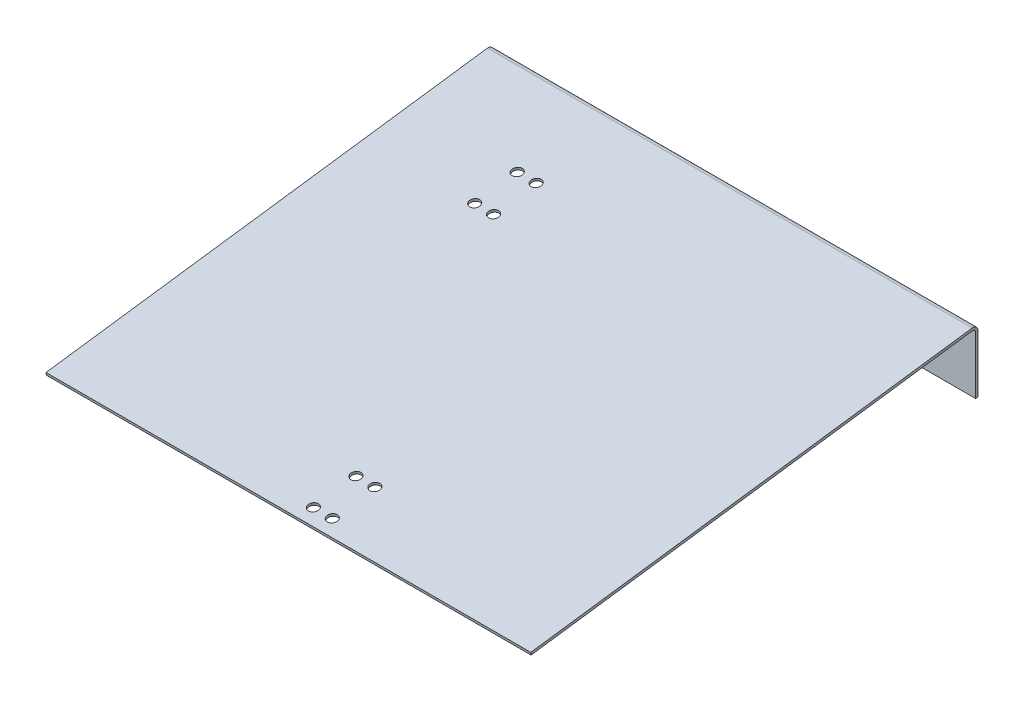
ISO-10303-21;
HEADER;
FILE_DESCRIPTION(('STEP AP214'),'2;1');
FILE_NAME('part.step','',(''),(''),'','','');
FILE_SCHEMA(('AUTOMOTIVE_DESIGN { 1 0 10303 214 1 1 1 1 }'));
ENDSEC;
DATA;
#1=APPLICATION_CONTEXT('core data for automotive mechanical design processes');
#2=APPLICATION_PROTOCOL_DEFINITION('international standard','automotive_design',2000,#1);
#3=PRODUCT_CONTEXT('',#1,'mechanical');
#4=PRODUCT('Part','Part','',(#3));
#5=PRODUCT_RELATED_PRODUCT_CATEGORY('part','',(#4));
#6=PRODUCT_DEFINITION_FORMATION('','',#4);
#7=PRODUCT_DEFINITION_CONTEXT('part definition',#1,'design');
#8=PRODUCT_DEFINITION('design','',#6,#7);
#9=PRODUCT_DEFINITION_SHAPE('','',#8);
#10=(LENGTH_UNIT() NAMED_UNIT(*) SI_UNIT(.MILLI.,.METRE.));
#11=(NAMED_UNIT(*) PLANE_ANGLE_UNIT() SI_UNIT($,.RADIAN.));
#12=(NAMED_UNIT(*) SI_UNIT($,.STERADIAN.) SOLID_ANGLE_UNIT());
#13=UNCERTAINTY_MEASURE_WITH_UNIT(LENGTH_MEASURE(1.E-05),#10,'distance_accuracy_value','');
#14=(GEOMETRIC_REPRESENTATION_CONTEXT(3) GLOBAL_UNCERTAINTY_ASSIGNED_CONTEXT((#13)) GLOBAL_UNIT_ASSIGNED_CONTEXT((#10,
#11,#12)) REPRESENTATION_CONTEXT('',''));
#15=CARTESIAN_POINT('',(0.,0.,0.));
#16=DIRECTION('',(0.,0.,1.));
#17=DIRECTION('',(1.,0.,0.));
#18=AXIS2_PLACEMENT_3D('',#15,#16,#17);
#19=CARTESIAN_POINT('',(304.8,76.2,-282.575));
#20=DIRECTION('',(0.,0.,1.));
#21=DIRECTION('',(1.,0.,0.));
#22=AXIS2_PLACEMENT_3D('',#19,#20,#21);
#23=PLANE('',#22);
#24=DIRECTION('',(0.,1.,0.));
#25=VECTOR('',#24,1.);
#26=CARTESIAN_POINT('',(-304.8,39.009334551279,-282.575));
#27=LINE('',#26,#25);
#28=CARTESIAN_POINT('',(-304.8,72.5626617948586,-282.575));
#29=VERTEX_POINT('',#28);
#30=CARTESIAN_POINT('',(-304.8,0.,-282.575));
#31=VERTEX_POINT('',#30);
#32=EDGE_CURVE('E63',#29,#31,#27,.F.);
#33=ORIENTED_EDGE('',*,*,#32,.F.);
#34=DIRECTION('',(1.,0.,0.));
#35=VECTOR('',#34,1.);
#36=CARTESIAN_POINT('',(304.8,72.5626617948586,-282.575));
#37=LINE('',#36,#35);
#38=CARTESIAN_POINT('',(304.8,72.5626617948586,-282.575));
#39=VERTEX_POINT('',#38);
#40=EDGE_CURVE('E84',#39,#29,#37,.F.);
#41=ORIENTED_EDGE('',*,*,#40,.F.);
#42=DIRECTION('',(0.,1.,0.));
#43=VECTOR('',#42,1.);
#44=CARTESIAN_POINT('',(304.8,39.009334551279,-282.575));
#45=LINE('',#44,#43);
#46=CARTESIAN_POINT('',(304.8,0.,-282.575));
#47=VERTEX_POINT('',#46);
#48=EDGE_CURVE('E83',#39,#47,#45,.F.);
#49=ORIENTED_EDGE('',*,*,#48,.T.);
#50=DIRECTION('',(1.,0.,0.));
#51=VECTOR('',#50,1.);
#52=CARTESIAN_POINT('',(0.,0.,-282.575));
#53=LINE('',#52,#51);
#54=EDGE_CURVE('E80',#47,#31,#53,.F.);
#55=ORIENTED_EDGE('',*,*,#54,.T.);
#56=EDGE_LOOP('',(#33,#41,#49,#55));
#57=FACE_BOUND('',#56,.T.);
#58=ADVANCED_FACE('F17',(#57),#23,.F.);
#59=CARTESIAN_POINT('',(0.,0.,-280.9875));
#60=DIRECTION('',(0.,1.,0.));
#61=DIRECTION('',(0.,0.,1.));
#62=AXIS2_PLACEMENT_3D('',#59,#60,#61);
#63=PLANE('',#62);
#64=ORIENTED_EDGE('',*,*,#54,.F.);
#65=DIRECTION('',(0.,0.,1.));
#66=VECTOR('',#65,1.);
#67=CARTESIAN_POINT('',(304.8,0.,-280.9875));
#68=LINE('',#67,#66);
#69=CARTESIAN_POINT('',(304.8,0.,-279.4));
#70=VERTEX_POINT('',#69);
#71=EDGE_CURVE('E72',#47,#70,#68,.T.);
#72=ORIENTED_EDGE('',*,*,#71,.T.);
#73=DIRECTION('',(1.,0.,0.));
#74=VECTOR('',#73,1.);
#75=CARTESIAN_POINT('',(304.8,0.,-279.4));
#76=LINE('',#75,#74);
#77=CARTESIAN_POINT('',(-304.8,0.,-279.4));
#78=VERTEX_POINT('',#77);
#79=EDGE_CURVE('E105',#78,#70,#76,.T.);
#80=ORIENTED_EDGE('',*,*,#79,.F.);
#81=DIRECTION('',(0.,0.,1.));
#82=VECTOR('',#81,1.);
#83=CARTESIAN_POINT('',(-304.8,0.,-280.9875));
#84=LINE('',#83,#82);
#85=EDGE_CURVE('E88',#31,#78,#84,.T.);
#86=ORIENTED_EDGE('',*,*,#85,.F.);
#87=EDGE_LOOP('',(#64,#72,#80,#86));
#88=FACE_BOUND('',#87,.T.);
#89=ADVANCED_FACE('F90',(#88),#63,.F.);
#90=CARTESIAN_POINT('',(304.8,72.5626617948586,-276.225));
#91=DIRECTION('',(1.,0.,0.));
#92=DIRECTION('',(0.,0.,-1.));
#93=AXIS2_PLACEMENT_3D('',#90,#91,#92);
#94=CYLINDRICAL_SURFACE('',#93,6.35);
#95=CARTESIAN_POINT('',(304.8,72.5626617948586,-276.225));
#96=DIRECTION('',(1.,0.,0.));
#97=DIRECTION('',(0.,0.,-1.));
#98=AXIS2_PLACEMENT_3D('',#95,#96,#97);
#99=CIRCLE('',#98,6.35);
#100=CARTESIAN_POINT('',(304.8,78.8544333619389,-275.367031149986));
#101=VERTEX_POINT('',#100);
#102=EDGE_CURVE('E165',#39,#101,#99,.T.);
#103=ORIENTED_EDGE('',*,*,#102,.F.);
#104=ORIENTED_EDGE('',*,*,#40,.T.);
#105=CARTESIAN_POINT('',(-304.8,72.5626617948586,-276.225));
#106=DIRECTION('',(1.,0.,0.));
#107=DIRECTION('',(0.,0.,-1.));
#108=AXIS2_PLACEMENT_3D('',#105,#106,#107);
#109=CIRCLE('',#108,6.35);
#110=CARTESIAN_POINT('',(-304.8,78.8544333619389,-275.367031149986));
#111=VERTEX_POINT('',#110);
#112=EDGE_CURVE('E20',#29,#111,#109,.T.);
#113=ORIENTED_EDGE('',*,*,#112,.T.);
#114=DIRECTION('',(1.,0.,0.));
#115=VECTOR('',#114,1.);
#116=CARTESIAN_POINT('',(304.8,78.854433361943,-275.367031150027));
#117=LINE('',#116,#115);
#118=EDGE_CURVE('E166',#111,#101,#117,.T.);
#119=ORIENTED_EDGE('',*,*,#118,.T.);
#120=EDGE_LOOP('',(#103,#104,#113,#119));
#121=FACE_BOUND('',#120,.T.);
#122=ADVANCED_FACE('F301',(#121),#94,.T.);
#123=CARTESIAN_POINT('',(304.8,76.2,-279.4));
#124=DIRECTION('',(0.,0.,1.));
#125=DIRECTION('',(1.,0.,0.));
#126=AXIS2_PLACEMENT_3D('',#123,#124,#125);
#127=PLANE('',#126);
#128=ORIENTED_EDGE('',*,*,#79,.T.);
#129=DIRECTION('',(0.,1.,0.));
#130=VECTOR('',#129,1.);
#131=CARTESIAN_POINT('',(304.8,76.2,-279.4));
#132=LINE('',#131,#130);
#133=CARTESIAN_POINT('',(304.8,72.5626617948586,-279.4));
#134=VERTEX_POINT('',#133);
#135=EDGE_CURVE('E94',#70,#134,#132,.T.);
#136=ORIENTED_EDGE('',*,*,#135,.T.);
#137=DIRECTION('',(1.,0.,0.));
#138=VECTOR('',#137,1.);
#139=CARTESIAN_POINT('',(304.8,72.5626617948586,-279.4));
#140=LINE('',#139,#138);
#141=CARTESIAN_POINT('',(-304.8,72.5626617948586,-279.4));
#142=VERTEX_POINT('',#141);
#143=EDGE_CURVE('E164',#134,#142,#140,.F.);
#144=ORIENTED_EDGE('',*,*,#143,.T.);
#145=DIRECTION('',(0.,1.,0.));
#146=VECTOR('',#145,1.);
#147=CARTESIAN_POINT('',(-304.8,76.2,-279.4));
#148=LINE('',#147,#146);
#149=EDGE_CURVE('E97',#142,#78,#148,.F.);
#150=ORIENTED_EDGE('',*,*,#149,.T.);
#151=EDGE_LOOP('',(#128,#136,#144,#150));
#152=FACE_BOUND('',#151,.T.);
#153=ADVANCED_FACE('F293',(#152),#127,.T.);
#154=CARTESIAN_POINT('',(304.8,3.1458857835397,279.828984424986));
#155=DIRECTION('',(0.,-0.990830168044301,-0.1351132047333));
#156=DIRECTION('',(0.,0.1351132047333,-0.990830168044301));
#157=AXIS2_PLACEMENT_3D('',#154,#155,#156);
#158=PLANE('',#157);
#159=CARTESIAN_POINT('',(12.7,5.70055573305718,261.094738128505));
#160=DIRECTION('',(0.,-0.990830168044301,-0.1351132047333));
#161=DIRECTION('',(0.,0.1351132047333,-0.990830168044301));
#162=AXIS2_PLACEMENT_3D('',#159,#160,#161);
#163=CIRCLE('',#162,6.35);
#164=CARTESIAN_POINT('',(12.7,6.55852458311364,254.802966561423));
#165=VERTEX_POINT('',#164);
#166=EDGE_CURVE('E135',#165,#165,#163,.T.);
#167=ORIENTED_EDGE('',*,*,#166,.T.);
#168=EDGE_LOOP('',(#167));
#169=FACE_BOUND('',#168,.T.);
#170=CARTESIAN_POINT('',(36.5125,5.70055573305718,261.094738128505));
#171=DIRECTION('',(0.,-0.990830168044301,-0.1351132047333));
#172=DIRECTION('',(0.,0.1351132047333,-0.990830168044301));
#173=AXIS2_PLACEMENT_3D('',#170,#171,#172);
#174=CIRCLE('',#173,6.35);
#175=CARTESIAN_POINT('',(36.5125,6.55852458311364,254.802966561423));
#176=VERTEX_POINT('',#175);
#177=EDGE_CURVE('E139',#176,#176,#174,.T.);
#178=ORIENTED_EDGE('',*,*,#177,.T.);
#179=EDGE_LOOP('',(#178));
#180=FACE_BOUND('',#179,.T.);
#181=CARTESIAN_POINT('',(36.5125,12.9932909585321,207.614679808418));
#182=DIRECTION('',(0.,-0.990830168044301,-0.1351132047333));
#183=DIRECTION('',(0.,0.1351132047333,-0.990830168044301));
#184=AXIS2_PLACEMENT_3D('',#181,#182,#183);
#185=CIRCLE('',#184,6.35);
#186=CARTESIAN_POINT('',(36.5125,13.8512598085886,201.322908241337));
#187=VERTEX_POINT('',#186);
#188=EDGE_CURVE('E142',#187,#187,#185,.T.);
#189=ORIENTED_EDGE('',*,*,#188,.T.);
#190=EDGE_LOOP('',(#189));
#191=FACE_BOUND('',#190,.T.);
#192=CARTESIAN_POINT('',(12.7,12.9932909585321,207.614679808418));
#193=DIRECTION('',(0.,-0.990830168044301,-0.1351132047333));
#194=DIRECTION('',(0.,0.1351132047333,-0.990830168044301));
#195=AXIS2_PLACEMENT_3D('',#192,#193,#194);
#196=CIRCLE('',#195,6.35);
#197=CARTESIAN_POINT('',(12.7,13.8512598085886,201.322908241337));
#198=VERTEX_POINT('',#197);
#199=EDGE_CURVE('E145',#198,#198,#196,.T.);
#200=ORIENTED_EDGE('',*,*,#199,.T.);
#201=EDGE_LOOP('',(#200));
#202=FACE_BOUND('',#201,.T.);
#203=CARTESIAN_POINT('',(-165.1,57.6076711614827,-119.55744167981));
#204=DIRECTION('',(0.,-0.990830168044301,-0.1351132047333));
#205=DIRECTION('',(0.,0.1351132047333,-0.990830168044301));
#206=AXIS2_PLACEMENT_3D('',#203,#204,#205);
#207=CIRCLE('',#206,6.35);
#208=CARTESIAN_POINT('',(-165.1,58.4656400115391,-125.849213246891));
#209=VERTEX_POINT('',#208);
#210=EDGE_CURVE('E148',#209,#209,#207,.T.);
#211=ORIENTED_EDGE('',*,*,#210,.T.);
#212=EDGE_LOOP('',(#211));
#213=FACE_BOUND('',#212,.T.);
#214=CARTESIAN_POINT('',(-141.2875,57.6076711614827,-119.55744167981));
#215=DIRECTION('',(0.,-0.990830168044301,-0.1351132047333));
#216=DIRECTION('',(0.,0.1351132047333,-0.990830168044301));
#217=AXIS2_PLACEMENT_3D('',#214,#215,#216);
#218=CIRCLE('',#217,6.35);
#219=CARTESIAN_POINT('',(-141.2875,58.4656400115391,-125.849213246891));
#220=VERTEX_POINT('',#219);
#221=EDGE_CURVE('E151',#220,#220,#218,.T.);
#222=ORIENTED_EDGE('',*,*,#221,.T.);
#223=EDGE_LOOP('',(#222));
#224=FACE_BOUND('',#223,.T.);
#225=CARTESIAN_POINT('',(-141.2875,64.9004063869563,-173.037500000001));
#226=DIRECTION('',(0.,-0.990830168044301,-0.1351132047333));
#227=DIRECTION('',(0.,0.1351132047333,-0.990830168044301));
#228=AXIS2_PLACEMENT_3D('',#225,#226,#227);
#229=CIRCLE('',#228,6.35);
#230=CARTESIAN_POINT('',(-141.2875,65.7583752370128,-179.329271567082));
#231=VERTEX_POINT('',#230);
#232=EDGE_CURVE('E154',#231,#231,#229,.T.);
#233=ORIENTED_EDGE('',*,*,#232,.T.);
#234=EDGE_LOOP('',(#233));
#235=FACE_BOUND('',#234,.T.);
#236=CARTESIAN_POINT('',(-165.1,64.9004063869563,-173.037500000001));
#237=DIRECTION('',(0.,-0.990830168044301,-0.1351132047333));
#238=DIRECTION('',(0.,0.1351132047333,-0.990830168044301));
#239=AXIS2_PLACEMENT_3D('',#236,#237,#238);
#240=CIRCLE('',#239,6.35);
#241=CARTESIAN_POINT('',(-165.1,65.7583752370128,-179.329271567082));
#242=VERTEX_POINT('',#241);
#243=EDGE_CURVE('E157',#242,#242,#240,.T.);
#244=ORIENTED_EDGE('',*,*,#243,.T.);
#245=EDGE_LOOP('',(#244));
#246=FACE_BOUND('',#245,.T.);
#247=DIRECTION('',(0.,0.135113204733291,-0.990830168044302));
#248=VECTOR('',#247,1.);
#249=CARTESIAN_POINT('',(-304.8,3.1458857835397,279.828984424986));
#250=LINE('',#249,#248);
#251=CARTESIAN_POINT('',(-304.8,3.1458857835331,279.828984425034));
#252=VERTEX_POINT('',#251);
#253=EDGE_CURVE('E188',#252,#111,#250,.T.);
#254=ORIENTED_EDGE('',*,*,#253,.F.);
#255=DIRECTION('',(1.,0.,0.));
#256=VECTOR('',#255,1.);
#257=CARTESIAN_POINT('',(0.,3.14588578351989,279.828984425131));
#258=LINE('',#257,#256);
#259=CARTESIAN_POINT('',(304.8,3.14588578352484,279.828984425095));
#260=VERTEX_POINT('',#259);
#261=EDGE_CURVE('E169',#260,#252,#258,.F.);
#262=ORIENTED_EDGE('',*,*,#261,.F.);
#263=DIRECTION('',(0.,0.135113204733291,-0.990830168044302));
#264=VECTOR('',#263,1.);
#265=CARTESIAN_POINT('',(304.8,3.1458857835397,279.828984424986));
#266=LINE('',#265,#264);
#267=EDGE_CURVE('E160',#260,#101,#266,.T.);
#268=ORIENTED_EDGE('',*,*,#267,.T.);
#269=ORIENTED_EDGE('',*,*,#118,.F.);
#270=EDGE_LOOP('',(#254,#262,#268,#269));
#271=FACE_BOUND('',#270,.T.);
#272=ADVANCED_FACE('F219',(#169,#180,#191,#202,#213,#224,#235,#246,#271),#158,.F.);
#273=CARTESIAN_POINT('',(0.,1.57294289177036,279.61449221262));
#274=DIRECTION('',(0.,-0.1351132047333,0.990830168044301));
#275=DIRECTION('',(0.,-0.990830168044301,-0.1351132047333));
#276=AXIS2_PLACEMENT_3D('',#273,#274,#275);
#277=PLANE('',#276);
#278=DIRECTION('',(0.,0.990830168046075,0.135113204720287));
#279=VECTOR('',#278,1.);
#280=CARTESIAN_POINT('',(-304.8,0.,279.4));
#281=LINE('',#280,#279);
#282=CARTESIAN_POINT('',(-304.8,-3.54694420614099E-12,279.400000000026));
#283=VERTEX_POINT('',#282);
#284=EDGE_CURVE('E191',#283,#252,#281,.T.);
#285=ORIENTED_EDGE('',*,*,#284,.F.);
#286=DIRECTION('',(1.,0.,0.));
#287=VECTOR('',#286,1.);
#288=CARTESIAN_POINT('',(304.8,0.,279.4));
#289=LINE('',#288,#287);
#290=CARTESIAN_POINT('',(304.8,-7.09388841159953E-12,279.400000000052));
#291=VERTEX_POINT('',#290);
#292=EDGE_CURVE('E138',#291,#283,#289,.F.);
#293=ORIENTED_EDGE('',*,*,#292,.F.);
#294=DIRECTION('',(0.,0.990830168046075,0.135113204720287));
#295=VECTOR('',#294,1.);
#296=CARTESIAN_POINT('',(304.8,0.,279.4));
#297=LINE('',#296,#295);
#298=EDGE_CURVE('E162',#291,#260,#297,.T.);
#299=ORIENTED_EDGE('',*,*,#298,.T.);
#300=ORIENTED_EDGE('',*,*,#261,.T.);
#301=EDGE_LOOP('',(#285,#293,#299,#300));
#302=FACE_BOUND('',#301,.T.);
#303=ADVANCED_FACE('F225',(#302),#277,.T.);
#304=CARTESIAN_POINT('',(-304.8,39.7958059971798,-0.686503893742832));
#305=DIRECTION('',(-1.,0.,0.));
#306=DIRECTION('',(0.,0.,1.));
#307=AXIS2_PLACEMENT_3D('',#304,#305,#306);
#308=PLANE('',#307);
#309=ORIENTED_EDGE('',*,*,#253,.T.);
#310=ORIENTED_EDGE('',*,*,#112,.F.);
#311=ORIENTED_EDGE('',*,*,#32,.T.);
#312=ORIENTED_EDGE('',*,*,#85,.T.);
#313=ORIENTED_EDGE('',*,*,#149,.F.);
#314=CARTESIAN_POINT('',(-304.8,72.5626617948586,-276.225));
#315=DIRECTION('',(1.,0.,0.));
#316=DIRECTION('',(0.,0.,-1.));
#317=AXIS2_PLACEMENT_3D('',#314,#315,#316);
#318=CIRCLE('',#317,3.175);
#319=CARTESIAN_POINT('',(-304.8,75.7085475784014,-275.796015574993));
#320=VERTEX_POINT('',#319);
#321=EDGE_CURVE('E163',#142,#320,#318,.T.);
#322=ORIENTED_EDGE('',*,*,#321,.T.);
#323=DIRECTION('',(0.,0.1351132047333,-0.990830168044301));
#324=VECTOR('',#323,1.);
#325=CARTESIAN_POINT('',(-304.8,0.,279.4));
#326=LINE('',#325,#324);
#327=EDGE_CURVE('E204',#283,#320,#326,.T.);
#328=ORIENTED_EDGE('',*,*,#327,.F.);
#329=ORIENTED_EDGE('',*,*,#284,.T.);
#330=EDGE_LOOP('',(#309,#310,#311,#312,#313,#322,#328,#329));
#331=FACE_BOUND('',#330,.T.);
#332=ADVANCED_FACE('F213',(#331),#308,.T.);
#333=CARTESIAN_POINT('',(304.8,72.5626617948586,-276.225));
#334=DIRECTION('',(1.,0.,0.));
#335=DIRECTION('',(0.,0.,-1.));
#336=AXIS2_PLACEMENT_3D('',#333,#334,#335);
#337=CYLINDRICAL_SURFACE('',#336,3.175);
#338=DIRECTION('',(1.,0.,0.));
#339=VECTOR('',#338,1.);
#340=CARTESIAN_POINT('',(304.8,75.7085475784035,-275.796015575015));
#341=LINE('',#340,#339);
#342=CARTESIAN_POINT('',(304.8,75.7085475784014,-275.796015574993));
#343=VERTEX_POINT('',#342);
#344=EDGE_CURVE('E231',#320,#343,#341,.T.);
#345=ORIENTED_EDGE('',*,*,#344,.F.);
#346=ORIENTED_EDGE('',*,*,#321,.F.);
#347=ORIENTED_EDGE('',*,*,#143,.F.);
#348=CARTESIAN_POINT('',(304.8,72.5626617948586,-276.225));
#349=DIRECTION('',(1.,0.,0.));
#350=DIRECTION('',(0.,0.,-1.));
#351=AXIS2_PLACEMENT_3D('',#348,#349,#350);
#352=CIRCLE('',#351,3.175);
#353=EDGE_CURVE('E35',#343,#134,#352,.F.);
#354=ORIENTED_EDGE('',*,*,#353,.F.);
#355=EDGE_LOOP('',(#345,#346,#347,#354));
#356=FACE_BOUND('',#355,.T.);
#357=ADVANCED_FACE('F237',(#356),#337,.F.);
#358=CARTESIAN_POINT('',(304.8,39.7958059971798,-0.686503893742832));
#359=DIRECTION('',(-1.,0.,0.));
#360=DIRECTION('',(0.,0.,1.));
#361=AXIS2_PLACEMENT_3D('',#358,#359,#360);
#362=PLANE('',#361);
#363=ORIENTED_EDGE('',*,*,#298,.F.);
#364=DIRECTION('',(0.,0.1351132047333,-0.990830168044301));
#365=VECTOR('',#364,1.);
#366=CARTESIAN_POINT('',(304.8,0.,279.4));
#367=LINE('',#366,#365);
#368=EDGE_CURVE('E134',#343,#291,#367,.F.);
#369=ORIENTED_EDGE('',*,*,#368,.F.);
#370=ORIENTED_EDGE('',*,*,#353,.T.);
#371=ORIENTED_EDGE('',*,*,#135,.F.);
#372=ORIENTED_EDGE('',*,*,#71,.F.);
#373=ORIENTED_EDGE('',*,*,#48,.F.);
#374=ORIENTED_EDGE('',*,*,#102,.T.);
#375=ORIENTED_EDGE('',*,*,#267,.F.);
#376=EDGE_LOOP('',(#363,#369,#370,#371,#372,#373,#374,#375));
#377=FACE_BOUND('',#376,.T.);
#378=ADVANCED_FACE('F93',(#377),#362,.F.);
#379=CARTESIAN_POINT('',(-165.1,64.9004063869642,-173.0375));
#380=DIRECTION('',(0.,-0.990830168044301,-0.1351132047333));
#381=DIRECTION('',(0.,0.1351132047333,-0.990830168044301));
#382=AXIS2_PLACEMENT_3D('',#379,#380,#381);
#383=CYLINDRICAL_SURFACE('',#382,6.35);
#384=ORIENTED_EDGE('',*,*,#243,.F.);
#385=EDGE_LOOP('',(#384));
#386=FACE_BOUND('',#385,.T.);
#387=CARTESIAN_POINT('',(-165.1,61.754520603403,-173.466484425031));
#388=DIRECTION('',(0.,-0.990830168044301,-0.1351132047333));
#389=DIRECTION('',(0.,0.1351132047333,-0.990830168044301));
#390=AXIS2_PLACEMENT_3D('',#387,#388,#389);
#391=CIRCLE('',#390,6.35);
#392=CARTESIAN_POINT('',(-165.1,62.6124894534595,-179.758255992112));
#393=VERTEX_POINT('',#392);
#394=EDGE_CURVE('E131',#393,#393,#391,.F.);
#395=ORIENTED_EDGE('',*,*,#394,.F.);
#396=EDGE_LOOP('',(#395));
#397=FACE_BOUND('',#396,.T.);
#398=ADVANCED_FACE('F245',(#386,#397),#383,.F.);
#399=CARTESIAN_POINT('',(-141.2875,64.9004063869642,-173.0375));
#400=DIRECTION('',(0.,-0.990830168044301,-0.1351132047333));
#401=DIRECTION('',(0.,0.1351132047333,-0.990830168044301));
#402=AXIS2_PLACEMENT_3D('',#399,#400,#401);
#403=CYLINDRICAL_SURFACE('',#402,6.35);
#404=ORIENTED_EDGE('',*,*,#232,.F.);
#405=EDGE_LOOP('',(#404));
#406=FACE_BOUND('',#405,.T.);
#407=CARTESIAN_POINT('',(-141.2875,61.754520603403,-173.466484425031));
#408=DIRECTION('',(0.,-0.990830168044301,-0.1351132047333));
#409=DIRECTION('',(0.,0.1351132047333,-0.990830168044301));
#410=AXIS2_PLACEMENT_3D('',#407,#408,#409);
#411=CIRCLE('',#410,6.35);
#412=CARTESIAN_POINT('',(-141.2875,62.6124894534595,-179.758255992112));
#413=VERTEX_POINT('',#412);
#414=EDGE_CURVE('E128',#413,#413,#411,.F.);
#415=ORIENTED_EDGE('',*,*,#414,.F.);
#416=EDGE_LOOP('',(#415));
#417=FACE_BOUND('',#416,.T.);
#418=ADVANCED_FACE('F278',(#406,#417),#403,.F.);
#419=CARTESIAN_POINT('',(-141.2875,57.6076711614656,-119.557441679812));
#420=DIRECTION('',(0.,-0.990830168044301,-0.1351132047333));
#421=DIRECTION('',(0.,0.1351132047333,-0.990830168044301));
#422=AXIS2_PLACEMENT_3D('',#419,#420,#421);
#423=CYLINDRICAL_SURFACE('',#422,6.35);
#424=ORIENTED_EDGE('',*,*,#221,.F.);
#425=EDGE_LOOP('',(#424));
#426=FACE_BOUND('',#425,.T.);
#427=CARTESIAN_POINT('',(-141.2875,54.4617853779294,-119.98642610484));
#428=DIRECTION('',(0.,-0.990830168044301,-0.1351132047333));
#429=DIRECTION('',(0.,0.1351132047333,-0.990830168044301));
#430=AXIS2_PLACEMENT_3D('',#427,#428,#429);
#431=CIRCLE('',#430,6.35);
#432=CARTESIAN_POINT('',(-141.2875,55.3197542279858,-126.278197671921));
#433=VERTEX_POINT('',#432);
#434=EDGE_CURVE('E125',#433,#433,#431,.F.);
#435=ORIENTED_EDGE('',*,*,#434,.F.);
#436=EDGE_LOOP('',(#435));
#437=FACE_BOUND('',#436,.T.);
#438=ADVANCED_FACE('F274',(#426,#437),#423,.F.);
#439=CARTESIAN_POINT('',(-165.1,57.6076711614656,-119.557441679812));
#440=DIRECTION('',(0.,-0.990830168044301,-0.1351132047333));
#441=DIRECTION('',(0.,0.1351132047333,-0.990830168044301));
#442=AXIS2_PLACEMENT_3D('',#439,#440,#441);
#443=CYLINDRICAL_SURFACE('',#442,6.35);
#444=ORIENTED_EDGE('',*,*,#210,.F.);
#445=EDGE_LOOP('',(#444));
#446=FACE_BOUND('',#445,.T.);
#447=CARTESIAN_POINT('',(-165.1,54.4617853779294,-119.98642610484));
#448=DIRECTION('',(0.,-0.990830168044301,-0.1351132047333));
#449=DIRECTION('',(0.,0.1351132047333,-0.990830168044301));
#450=AXIS2_PLACEMENT_3D('',#447,#448,#449);
#451=CIRCLE('',#450,6.35);
#452=CARTESIAN_POINT('',(-165.1,55.3197542279858,-126.278197671921));
#453=VERTEX_POINT('',#452);
#454=EDGE_CURVE('E122',#453,#453,#451,.F.);
#455=ORIENTED_EDGE('',*,*,#454,.F.);
#456=EDGE_LOOP('',(#455));
#457=FACE_BOUND('',#456,.T.);
#458=ADVANCED_FACE('F270',(#446,#457),#443,.F.);
#459=CARTESIAN_POINT('',(12.7,12.9932909585325,207.614679808418));
#460=DIRECTION('',(0.,-0.990830168044301,-0.1351132047333));
#461=DIRECTION('',(0.,0.1351132047333,-0.990830168044301));
#462=AXIS2_PLACEMENT_3D('',#459,#460,#461);
#463=CYLINDRICAL_SURFACE('',#462,6.35);
#464=ORIENTED_EDGE('',*,*,#199,.F.);
#465=EDGE_LOOP('',(#464));
#466=FACE_BOUND('',#465,.T.);
#467=CARTESIAN_POINT('',(12.7,9.84740517499125,207.18569538339));
#468=DIRECTION('',(0.,-0.990830168044301,-0.1351132047333));
#469=DIRECTION('',(0.,0.1351132047333,-0.990830168044301));
#470=AXIS2_PLACEMENT_3D('',#467,#468,#469);
#471=CIRCLE('',#470,6.35);
#472=CARTESIAN_POINT('',(12.7,10.7053740250477,200.893923816308));
#473=VERTEX_POINT('',#472);
#474=EDGE_CURVE('E119',#473,#473,#471,.F.);
#475=ORIENTED_EDGE('',*,*,#474,.F.);
#476=EDGE_LOOP('',(#475));
#477=FACE_BOUND('',#476,.T.);
#478=ADVANCED_FACE('F266',(#466,#477),#463,.F.);
#479=CARTESIAN_POINT('',(36.5125,12.9932909585325,207.614679808418));
#480=DIRECTION('',(0.,-0.990830168044301,-0.1351132047333));
#481=DIRECTION('',(0.,0.1351132047333,-0.990830168044301));
#482=AXIS2_PLACEMENT_3D('',#479,#480,#481);
#483=CYLINDRICAL_SURFACE('',#482,6.35);
#484=ORIENTED_EDGE('',*,*,#188,.F.);
#485=EDGE_LOOP('',(#484));
#486=FACE_BOUND('',#485,.T.);
#487=CARTESIAN_POINT('',(36.5125,9.84740517499125,207.18569538339));
#488=DIRECTION('',(0.,-0.990830168044301,-0.1351132047333));
#489=DIRECTION('',(0.,0.1351132047333,-0.990830168044301));
#490=AXIS2_PLACEMENT_3D('',#487,#488,#489);
#491=CIRCLE('',#490,6.35);
#492=CARTESIAN_POINT('',(36.5125,10.7053740250477,200.893923816308));
#493=VERTEX_POINT('',#492);
#494=EDGE_CURVE('E116',#493,#493,#491,.F.);
#495=ORIENTED_EDGE('',*,*,#494,.F.);
#496=EDGE_LOOP('',(#495));
#497=FACE_BOUND('',#496,.T.);
#498=ADVANCED_FACE('F262',(#486,#497),#483,.F.);
#499=CARTESIAN_POINT('',(36.5125,5.70055573305166,261.094738128504));
#500=DIRECTION('',(0.,-0.990830168044301,-0.1351132047333));
#501=DIRECTION('',(0.,0.1351132047333,-0.990830168044301));
#502=AXIS2_PLACEMENT_3D('',#499,#500,#501);
#503=CYLINDRICAL_SURFACE('',#502,6.35);
#504=ORIENTED_EDGE('',*,*,#177,.F.);
#505=EDGE_LOOP('',(#504));
#506=FACE_BOUND('',#505,.T.);
#507=CARTESIAN_POINT('',(36.5125,2.55466994952063,260.665753703477));
#508=DIRECTION('',(0.,-0.990830168044301,-0.1351132047333));
#509=DIRECTION('',(0.,0.1351132047333,-0.990830168044301));
#510=AXIS2_PLACEMENT_3D('',#507,#508,#509);
#511=CIRCLE('',#510,6.35);
#512=CARTESIAN_POINT('',(36.5125,3.41263879957708,254.373982136396));
#513=VERTEX_POINT('',#512);
#514=EDGE_CURVE('E26',#513,#513,#511,.F.);
#515=ORIENTED_EDGE('',*,*,#514,.F.);
#516=EDGE_LOOP('',(#515));
#517=FACE_BOUND('',#516,.T.);
#518=ADVANCED_FACE('F255',(#506,#517),#503,.F.);
#519=CARTESIAN_POINT('',(12.7,5.70055573305166,261.094738128504));
#520=DIRECTION('',(0.,-0.990830168044301,-0.1351132047333));
#521=DIRECTION('',(0.,0.1351132047333,-0.990830168044301));
#522=AXIS2_PLACEMENT_3D('',#519,#520,#521);
#523=CYLINDRICAL_SURFACE('',#522,6.35);
#524=ORIENTED_EDGE('',*,*,#166,.F.);
#525=EDGE_LOOP('',(#524));
#526=FACE_BOUND('',#525,.T.);
#527=CARTESIAN_POINT('',(12.7,2.55466994952063,260.665753703477));
#528=DIRECTION('',(0.,-0.990830168044301,-0.1351132047333));
#529=DIRECTION('',(0.,0.1351132047333,-0.990830168044301));
#530=AXIS2_PLACEMENT_3D('',#527,#528,#529);
#531=CIRCLE('',#530,6.35);
#532=CARTESIAN_POINT('',(12.7,3.41263879957708,254.373982136396));
#533=VERTEX_POINT('',#532);
#534=EDGE_CURVE('E11',#533,#533,#531,.F.);
#535=ORIENTED_EDGE('',*,*,#534,.F.);
#536=EDGE_LOOP('',(#535));
#537=FACE_BOUND('',#536,.T.);
#538=ADVANCED_FACE('F249',(#526,#537),#523,.F.);
#539=CARTESIAN_POINT('',(304.8,0.,279.4));
#540=DIRECTION('',(0.,-0.990830168044301,-0.1351132047333));
#541=DIRECTION('',(0.,0.1351132047333,-0.990830168044301));
#542=AXIS2_PLACEMENT_3D('',#539,#540,#541);
#543=PLANE('',#542);
#544=ORIENTED_EDGE('',*,*,#534,.T.);
#545=EDGE_LOOP('',(#544));
#546=FACE_BOUND('',#545,.T.);
#547=ORIENTED_EDGE('',*,*,#514,.T.);
#548=EDGE_LOOP('',(#547));
#549=FACE_BOUND('',#548,.T.);
#550=ORIENTED_EDGE('',*,*,#494,.T.);
#551=EDGE_LOOP('',(#550));
#552=FACE_BOUND('',#551,.T.);
#553=ORIENTED_EDGE('',*,*,#474,.T.);
#554=EDGE_LOOP('',(#553));
#555=FACE_BOUND('',#554,.T.);
#556=ORIENTED_EDGE('',*,*,#454,.T.);
#557=EDGE_LOOP('',(#556));
#558=FACE_BOUND('',#557,.T.);
#559=ORIENTED_EDGE('',*,*,#434,.T.);
#560=EDGE_LOOP('',(#559));
#561=FACE_BOUND('',#560,.T.);
#562=ORIENTED_EDGE('',*,*,#414,.T.);
#563=EDGE_LOOP('',(#562));
#564=FACE_BOUND('',#563,.T.);
#565=ORIENTED_EDGE('',*,*,#394,.T.);
#566=EDGE_LOOP('',(#565));
#567=FACE_BOUND('',#566,.T.);
#568=ORIENTED_EDGE('',*,*,#344,.T.);
#569=ORIENTED_EDGE('',*,*,#368,.T.);
#570=ORIENTED_EDGE('',*,*,#292,.T.);
#571=ORIENTED_EDGE('',*,*,#327,.T.);
#572=EDGE_LOOP('',(#568,#569,#570,#571));
#573=FACE_BOUND('',#572,.T.);
#574=ADVANCED_FACE('F230',(#546,#549,#552,#555,#558,#561,#564,#567,#573),#543,.T.);
#575=CLOSED_SHELL('',(#58,#89,#122,#153,#272,#303,#332,#357,#378,#398,#418,#438,#458,#478,#498,
#518,#538,#574));
#576=MANIFOLD_SOLID_BREP('B1',#575);
#577=ADVANCED_BREP_SHAPE_REPRESENTATION('',(#18,#576),#14);
#578=SHAPE_DEFINITION_REPRESENTATION(#9,#577);
ENDSEC;
END-ISO-10303-21;
